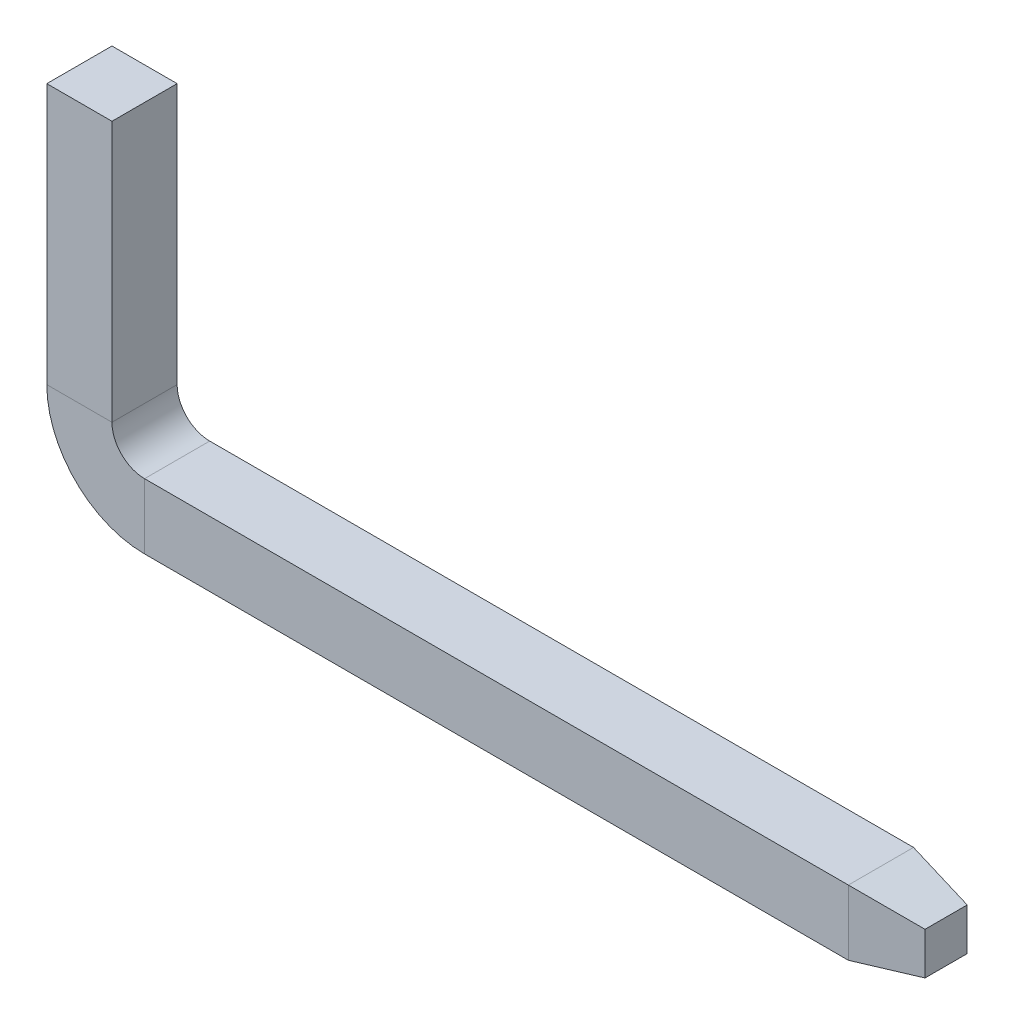
ISO-10303-21;
HEADER;
FILE_DESCRIPTION(('STEP AP214'),'2;1');
FILE_NAME('part.step','',(''),(''),'','','');
FILE_SCHEMA(('AUTOMOTIVE_DESIGN { 1 0 10303 214 1 1 1 1 }'));
ENDSEC;
DATA;
#1=APPLICATION_CONTEXT('core data for automotive mechanical design processes');
#2=APPLICATION_PROTOCOL_DEFINITION('international standard','automotive_design',2000,#1);
#3=PRODUCT_CONTEXT('',#1,'mechanical');
#4=PRODUCT('Part','Part','',(#3));
#5=PRODUCT_RELATED_PRODUCT_CATEGORY('part','',(#4));
#6=PRODUCT_DEFINITION_FORMATION('','',#4);
#7=PRODUCT_DEFINITION_CONTEXT('part definition',#1,'design');
#8=PRODUCT_DEFINITION('design','',#6,#7);
#9=PRODUCT_DEFINITION_SHAPE('','',#8);
#10=(LENGTH_UNIT() NAMED_UNIT(*) SI_UNIT(.MILLI.,.METRE.));
#11=(NAMED_UNIT(*) PLANE_ANGLE_UNIT() SI_UNIT($,.RADIAN.));
#12=(NAMED_UNIT(*) SI_UNIT($,.STERADIAN.) SOLID_ANGLE_UNIT());
#13=UNCERTAINTY_MEASURE_WITH_UNIT(LENGTH_MEASURE(1.E-05),#10,'distance_accuracy_value','');
#14=(GEOMETRIC_REPRESENTATION_CONTEXT(3) GLOBAL_UNCERTAINTY_ASSIGNED_CONTEXT((#13)) GLOBAL_UNIT_ASSIGNED_CONTEXT((#10,
#11,#12)) REPRESENTATION_CONTEXT('',''));
#15=CARTESIAN_POINT('',(0.,0.,0.));
#16=DIRECTION('',(0.,0.,1.));
#17=DIRECTION('',(1.,0.,0.));
#18=AXIS2_PLACEMENT_3D('',#15,#16,#17);
#19=CARTESIAN_POINT('',(0.,0.,0.));
#20=DIRECTION('',(0.,-1.,0.));
#21=DIRECTION('',(0.,0.,-1.));
#22=AXIS2_PLACEMENT_3D('',#19,#20,#21);
#23=PLANE('',#22);
#24=DIRECTION('',(0.,0.,-1.));
#25=VECTOR('',#24,1.);
#26=CARTESIAN_POINT('',(0.25,0.,0.25));
#27=LINE('',#26,#25);
#28=CARTESIAN_POINT('',(0.25,0.,0.25));
#29=VERTEX_POINT('',#28);
#30=CARTESIAN_POINT('',(0.25,0.,-0.25));
#31=VERTEX_POINT('',#30);
#32=EDGE_CURVE('E123',#29,#31,#27,.T.);
#33=ORIENTED_EDGE('',*,*,#32,.T.);
#34=DIRECTION('',(-1.,0.,0.));
#35=VECTOR('',#34,1.);
#36=CARTESIAN_POINT('',(-0.25,0.,-0.25));
#37=LINE('',#36,#35);
#38=CARTESIAN_POINT('',(-0.25,0.,-0.25));
#39=VERTEX_POINT('',#38);
#40=EDGE_CURVE('E151',#31,#39,#37,.T.);
#41=ORIENTED_EDGE('',*,*,#40,.T.);
#42=DIRECTION('',(0.,0.,1.));
#43=VECTOR('',#42,1.);
#44=CARTESIAN_POINT('',(-0.25,0.,0.25));
#45=LINE('',#44,#43);
#46=CARTESIAN_POINT('',(-0.25,0.,0.25));
#47=VERTEX_POINT('',#46);
#48=EDGE_CURVE('E154',#39,#47,#45,.T.);
#49=ORIENTED_EDGE('',*,*,#48,.T.);
#50=DIRECTION('',(1.,0.,0.));
#51=VECTOR('',#50,1.);
#52=CARTESIAN_POINT('',(-0.25,0.,0.25));
#53=LINE('',#52,#51);
#54=EDGE_CURVE('E171',#47,#29,#53,.T.);
#55=ORIENTED_EDGE('',*,*,#54,.T.);
#56=EDGE_LOOP('',(#33,#41,#49,#55));
#57=FACE_BOUND('',#56,.T.);
#58=ADVANCED_FACE('F32',(#57),#23,.F.);
#59=CARTESIAN_POINT('',(0.25,0.,0.25));
#60=DIRECTION('',(-1.,0.,0.));
#61=DIRECTION('',(0.,0.,1.));
#62=AXIS2_PLACEMENT_3D('',#59,#60,#61);
#63=PLANE('',#62);
#64=DIRECTION('',(0.,-1.,0.));
#65=VECTOR('',#64,1.);
#66=CARTESIAN_POINT('',(0.25,0.,-0.25));
#67=LINE('',#66,#65);
#68=CARTESIAN_POINT('',(0.25,-2.,-0.25));
#69=VERTEX_POINT('',#68);
#70=EDGE_CURVE('E159',#31,#69,#67,.T.);
#71=ORIENTED_EDGE('',*,*,#70,.F.);
#72=ORIENTED_EDGE('',*,*,#32,.F.);
#73=DIRECTION('',(0.,-1.,0.));
#74=VECTOR('',#73,1.);
#75=CARTESIAN_POINT('',(0.25,0.,0.25));
#76=LINE('',#75,#74);
#77=CARTESIAN_POINT('',(0.25,-2.,0.25));
#78=VERTEX_POINT('',#77);
#79=EDGE_CURVE('E186',#29,#78,#76,.T.);
#80=ORIENTED_EDGE('',*,*,#79,.T.);
#81=DIRECTION('',(0.,0.,-1.));
#82=VECTOR('',#81,1.);
#83=CARTESIAN_POINT('',(0.25,-2.,0.25));
#84=LINE('',#83,#82);
#85=EDGE_CURVE('E202',#78,#69,#84,.T.);
#86=ORIENTED_EDGE('',*,*,#85,.T.);
#87=EDGE_LOOP('',(#71,#72,#80,#86));
#88=FACE_BOUND('',#87,.T.);
#89=ADVANCED_FACE('F271',(#88),#63,.F.);
#90=CARTESIAN_POINT('',(-0.25,0.,-0.25));
#91=DIRECTION('',(0.,0.,1.));
#92=DIRECTION('',(1.,0.,0.));
#93=AXIS2_PLACEMENT_3D('',#90,#91,#92);
#94=PLANE('',#93);
#95=DIRECTION('',(0.,-1.,0.));
#96=VECTOR('',#95,1.);
#97=CARTESIAN_POINT('',(-0.25,0.,-0.25));
#98=LINE('',#97,#96);
#99=CARTESIAN_POINT('',(-0.25,-2.,-0.25));
#100=VERTEX_POINT('',#99);
#101=EDGE_CURVE('E158',#39,#100,#98,.T.);
#102=ORIENTED_EDGE('',*,*,#101,.F.);
#103=ORIENTED_EDGE('',*,*,#40,.F.);
#104=ORIENTED_EDGE('',*,*,#70,.T.);
#105=DIRECTION('',(-1.,0.,0.));
#106=VECTOR('',#105,1.);
#107=CARTESIAN_POINT('',(-0.25,-2.,-0.25));
#108=LINE('',#107,#106);
#109=EDGE_CURVE('E155',#69,#100,#108,.T.);
#110=ORIENTED_EDGE('',*,*,#109,.T.);
#111=EDGE_LOOP('',(#102,#103,#104,#110));
#112=FACE_BOUND('',#111,.T.);
#113=ADVANCED_FACE('F263',(#112),#94,.F.);
#114=CARTESIAN_POINT('',(-0.25,0.,0.25));
#115=DIRECTION('',(1.,0.,0.));
#116=DIRECTION('',(0.,0.,-1.));
#117=AXIS2_PLACEMENT_3D('',#114,#115,#116);
#118=PLANE('',#117);
#119=DIRECTION('',(0.,-1.,0.));
#120=VECTOR('',#119,1.);
#121=CARTESIAN_POINT('',(-0.25,0.,0.25));
#122=LINE('',#121,#120);
#123=CARTESIAN_POINT('',(-0.25,-2.,0.25));
#124=VERTEX_POINT('',#123);
#125=EDGE_CURVE('E174',#47,#124,#122,.T.);
#126=ORIENTED_EDGE('',*,*,#125,.F.);
#127=ORIENTED_EDGE('',*,*,#48,.F.);
#128=ORIENTED_EDGE('',*,*,#101,.T.);
#129=DIRECTION('',(0.,0.,1.));
#130=VECTOR('',#129,1.);
#131=CARTESIAN_POINT('',(-0.25,-2.,0.25));
#132=LINE('',#131,#130);
#133=EDGE_CURVE('E162',#100,#124,#132,.T.);
#134=ORIENTED_EDGE('',*,*,#133,.T.);
#135=EDGE_LOOP('',(#126,#127,#128,#134));
#136=FACE_BOUND('',#135,.T.);
#137=ADVANCED_FACE('F255',(#136),#118,.F.);
#138=CARTESIAN_POINT('',(-0.25,0.,0.25));
#139=DIRECTION('',(0.,0.,-1.));
#140=DIRECTION('',(-1.,0.,0.));
#141=AXIS2_PLACEMENT_3D('',#138,#139,#140);
#142=PLANE('',#141);
#143=DIRECTION('',(1.,0.,0.));
#144=VECTOR('',#143,1.);
#145=CARTESIAN_POINT('',(-0.25,-2.,0.25));
#146=LINE('',#145,#144);
#147=EDGE_CURVE('E177',#124,#78,#146,.T.);
#148=ORIENTED_EDGE('',*,*,#147,.T.);
#149=ORIENTED_EDGE('',*,*,#79,.F.);
#150=ORIENTED_EDGE('',*,*,#54,.F.);
#151=ORIENTED_EDGE('',*,*,#125,.T.);
#152=EDGE_LOOP('',(#148,#149,#150,#151));
#153=FACE_BOUND('',#152,.T.);
#154=ADVANCED_FACE('F253',(#153),#142,.F.);
#155=CARTESIAN_POINT('',(0.5,-2.,0.));
#156=DIRECTION('',(0.,0.,1.));
#157=DIRECTION('',(1.,0.,0.));
#158=AXIS2_PLACEMENT_3D('',#155,#156,#157);
#159=CYLINDRICAL_SURFACE('',#158,0.25);
#160=CARTESIAN_POINT('',(0.5,-2.,-0.25));
#161=DIRECTION('',(0.,0.,1.));
#162=DIRECTION('',(-1.,0.,0.));
#163=AXIS2_PLACEMENT_3D('',#160,#161,#162);
#164=CIRCLE('',#163,0.25);
#165=CARTESIAN_POINT('',(0.500000000000002,-2.25,-0.25));
#166=VERTEX_POINT('',#165);
#167=EDGE_CURVE('E164',#69,#166,#164,.T.);
#168=ORIENTED_EDGE('',*,*,#167,.F.);
#169=ORIENTED_EDGE('',*,*,#85,.F.);
#170=CARTESIAN_POINT('',(0.5,-2.,0.25));
#171=DIRECTION('',(0.,0.,1.));
#172=DIRECTION('',(-1.,0.,0.));
#173=AXIS2_PLACEMENT_3D('',#170,#171,#172);
#174=CIRCLE('',#173,0.25);
#175=CARTESIAN_POINT('',(0.500000000000002,-2.25,0.25));
#176=VERTEX_POINT('',#175);
#177=EDGE_CURVE('E188',#78,#176,#174,.T.);
#178=ORIENTED_EDGE('',*,*,#177,.T.);
#179=DIRECTION('',(0.,0.,-1.));
#180=VECTOR('',#179,1.);
#181=CARTESIAN_POINT('',(0.500000000000002,-2.25,0.25));
#182=LINE('',#181,#180);
#183=EDGE_CURVE('E196',#176,#166,#182,.T.);
#184=ORIENTED_EDGE('',*,*,#183,.T.);
#185=EDGE_LOOP('',(#168,#169,#178,#184));
#186=FACE_BOUND('',#185,.T.);
#187=ADVANCED_FACE('F200',(#186),#159,.F.);
#188=CARTESIAN_POINT('',(-0.25,-2.,-0.25));
#189=DIRECTION('',(0.,0.,1.));
#190=DIRECTION('',(1.,0.,0.));
#191=AXIS2_PLACEMENT_3D('',#188,#189,#190);
#192=PLANE('',#191);
#193=CARTESIAN_POINT('',(0.5,-2.,-0.25));
#194=DIRECTION('',(0.,0.,1.));
#195=DIRECTION('',(-1.,0.,0.));
#196=AXIS2_PLACEMENT_3D('',#193,#194,#195);
#197=CIRCLE('',#196,0.75);
#198=CARTESIAN_POINT('',(0.500000000000005,-2.75,-0.25));
#199=VERTEX_POINT('',#198);
#200=EDGE_CURVE('E77',#100,#199,#197,.T.);
#201=ORIENTED_EDGE('',*,*,#200,.F.);
#202=ORIENTED_EDGE('',*,*,#109,.F.);
#203=ORIENTED_EDGE('',*,*,#167,.T.);
#204=DIRECTION('',(0.,-1.,0.));
#205=VECTOR('',#204,1.);
#206=CARTESIAN_POINT('',(0.500000000000005,-2.75,-0.25));
#207=LINE('',#206,#205);
#208=EDGE_CURVE('E144',#166,#199,#207,.T.);
#209=ORIENTED_EDGE('',*,*,#208,.T.);
#210=EDGE_LOOP('',(#201,#202,#203,#209));
#211=FACE_BOUND('',#210,.T.);
#212=ADVANCED_FACE('F260',(#211),#192,.F.);
#213=CARTESIAN_POINT('',(0.5,-2.,0.));
#214=DIRECTION('',(0.,0.,1.));
#215=DIRECTION('',(1.,0.,0.));
#216=AXIS2_PLACEMENT_3D('',#213,#214,#215);
#217=CYLINDRICAL_SURFACE('',#216,0.75);
#218=CARTESIAN_POINT('',(0.5,-2.,0.25));
#219=DIRECTION('',(0.,0.,1.));
#220=DIRECTION('',(-1.,0.,0.));
#221=AXIS2_PLACEMENT_3D('',#218,#219,#220);
#222=CIRCLE('',#221,0.75);
#223=CARTESIAN_POINT('',(0.500000000000005,-2.75,0.25));
#224=VERTEX_POINT('',#223);
#225=EDGE_CURVE('E66',#124,#224,#222,.T.);
#226=ORIENTED_EDGE('',*,*,#225,.F.);
#227=ORIENTED_EDGE('',*,*,#133,.F.);
#228=ORIENTED_EDGE('',*,*,#200,.T.);
#229=DIRECTION('',(0.,0.,1.));
#230=VECTOR('',#229,1.);
#231=CARTESIAN_POINT('',(0.500000000000005,-2.75,0.25));
#232=LINE('',#231,#230);
#233=EDGE_CURVE('E165',#199,#224,#232,.T.);
#234=ORIENTED_EDGE('',*,*,#233,.T.);
#235=EDGE_LOOP('',(#226,#227,#228,#234));
#236=FACE_BOUND('',#235,.T.);
#237=ADVANCED_FACE('F252',(#236),#217,.T.);
#238=CARTESIAN_POINT('',(-0.25,-2.,0.25));
#239=DIRECTION('',(0.,0.,-1.));
#240=DIRECTION('',(-1.,0.,0.));
#241=AXIS2_PLACEMENT_3D('',#238,#239,#240);
#242=PLANE('',#241);
#243=DIRECTION('',(0.,1.,0.));
#244=VECTOR('',#243,1.);
#245=CARTESIAN_POINT('',(0.500000000000005,-2.75,0.25));
#246=LINE('',#245,#244);
#247=EDGE_CURVE('E150',#224,#176,#246,.T.);
#248=ORIENTED_EDGE('',*,*,#247,.T.);
#249=ORIENTED_EDGE('',*,*,#177,.F.);
#250=ORIENTED_EDGE('',*,*,#147,.F.);
#251=ORIENTED_EDGE('',*,*,#225,.T.);
#252=EDGE_LOOP('',(#248,#249,#250,#251));
#253=FACE_BOUND('',#252,.T.);
#254=ADVANCED_FACE('F192',(#253),#242,.F.);
#255=CARTESIAN_POINT('',(0.500000000000003,-2.25,0.25));
#256=DIRECTION('',(0.,-1.,0.));
#257=DIRECTION('',(0.,0.,-1.));
#258=AXIS2_PLACEMENT_3D('',#255,#256,#257);
#259=PLANE('',#258);
#260=DIRECTION('',(1.,0.,0.));
#261=VECTOR('',#260,1.);
#262=CARTESIAN_POINT('',(0.500000000000003,-2.25,-0.25));
#263=LINE('',#262,#261);
#264=CARTESIAN_POINT('',(5.9,-2.25,-0.25));
#265=VERTEX_POINT('',#264);
#266=EDGE_CURVE('E134',#166,#265,#263,.T.);
#267=ORIENTED_EDGE('',*,*,#266,.F.);
#268=ORIENTED_EDGE('',*,*,#183,.F.);
#269=DIRECTION('',(1.,0.,0.));
#270=VECTOR('',#269,1.);
#271=CARTESIAN_POINT('',(0.500000000000003,-2.25,0.25));
#272=LINE('',#271,#270);
#273=CARTESIAN_POINT('',(5.9,-2.25,0.25));
#274=VERTEX_POINT('',#273);
#275=EDGE_CURVE('E141',#176,#274,#272,.T.);
#276=ORIENTED_EDGE('',*,*,#275,.T.);
#277=DIRECTION('',(0.,0.,-1.));
#278=VECTOR('',#277,1.);
#279=CARTESIAN_POINT('',(5.9,-2.25,0.25));
#280=LINE('',#279,#278);
#281=EDGE_CURVE('E119',#274,#265,#280,.T.);
#282=ORIENTED_EDGE('',*,*,#281,.T.);
#283=EDGE_LOOP('',(#267,#268,#276,#282));
#284=FACE_BOUND('',#283,.T.);
#285=ADVANCED_FACE('F138',(#284),#259,.F.);
#286=CARTESIAN_POINT('',(0.500000000000003,-2.75,-0.25));
#287=DIRECTION('',(0.,0.,1.));
#288=DIRECTION('',(1.,0.,0.));
#289=AXIS2_PLACEMENT_3D('',#286,#287,#288);
#290=PLANE('',#289);
#291=DIRECTION('',(1.,0.,0.));
#292=VECTOR('',#291,1.);
#293=CARTESIAN_POINT('',(0.500000000000003,-2.75,-0.25));
#294=LINE('',#293,#292);
#295=CARTESIAN_POINT('',(5.9,-2.75,-0.25));
#296=VERTEX_POINT('',#295);
#297=EDGE_CURVE('E133',#199,#296,#294,.T.);
#298=ORIENTED_EDGE('',*,*,#297,.F.);
#299=ORIENTED_EDGE('',*,*,#208,.F.);
#300=ORIENTED_EDGE('',*,*,#266,.T.);
#301=DIRECTION('',(0.,-1.,0.));
#302=VECTOR('',#301,1.);
#303=CARTESIAN_POINT('',(5.9,-2.75,-0.25));
#304=LINE('',#303,#302);
#305=EDGE_CURVE('E127',#265,#296,#304,.T.);
#306=ORIENTED_EDGE('',*,*,#305,.T.);
#307=EDGE_LOOP('',(#298,#299,#300,#306));
#308=FACE_BOUND('',#307,.T.);
#309=ADVANCED_FACE('F143',(#308),#290,.F.);
#310=CARTESIAN_POINT('',(0.500000000000003,-2.75,0.25));
#311=DIRECTION('',(0.,1.,0.));
#312=DIRECTION('',(0.,0.,1.));
#313=AXIS2_PLACEMENT_3D('',#310,#311,#312);
#314=PLANE('',#313);
#315=DIRECTION('',(1.,0.,0.));
#316=VECTOR('',#315,1.);
#317=CARTESIAN_POINT('',(0.500000000000003,-2.75,0.25));
#318=LINE('',#317,#316);
#319=CARTESIAN_POINT('',(5.9,-2.75,0.25));
#320=VERTEX_POINT('',#319);
#321=EDGE_CURVE('E40',#224,#320,#318,.T.);
#322=ORIENTED_EDGE('',*,*,#321,.F.);
#323=ORIENTED_EDGE('',*,*,#233,.F.);
#324=ORIENTED_EDGE('',*,*,#297,.T.);
#325=DIRECTION('',(0.,0.,1.));
#326=VECTOR('',#325,1.);
#327=CARTESIAN_POINT('',(5.9,-2.75,0.25));
#328=LINE('',#327,#326);
#329=EDGE_CURVE('E168',#296,#320,#328,.T.);
#330=ORIENTED_EDGE('',*,*,#329,.T.);
#331=EDGE_LOOP('',(#322,#323,#324,#330));
#332=FACE_BOUND('',#331,.T.);
#333=ADVANCED_FACE('F230',(#332),#314,.F.);
#334=CARTESIAN_POINT('',(0.500000000000003,-2.75,0.25));
#335=DIRECTION('',(0.,0.,-1.));
#336=DIRECTION('',(-1.,0.,0.));
#337=AXIS2_PLACEMENT_3D('',#334,#335,#336);
#338=PLANE('',#337);
#339=DIRECTION('',(0.,1.,0.));
#340=VECTOR('',#339,1.);
#341=CARTESIAN_POINT('',(5.9,-2.75,0.25));
#342=LINE('',#341,#340);
#343=EDGE_CURVE('E11',#320,#274,#342,.T.);
#344=ORIENTED_EDGE('',*,*,#343,.T.);
#345=ORIENTED_EDGE('',*,*,#275,.F.);
#346=ORIENTED_EDGE('',*,*,#247,.F.);
#347=ORIENTED_EDGE('',*,*,#321,.T.);
#348=EDGE_LOOP('',(#344,#345,#346,#347));
#349=FACE_BOUND('',#348,.T.);
#350=ADVANCED_FACE('F232',(#349),#338,.F.);
#351=CARTESIAN_POINT('',(5.9,-2.75,-0.25));
#352=DIRECTION('',(0.173648177666931,0.,-0.984807753012208));
#353=DIRECTION('',(-0.984807753012208,0.,-0.173648177666931));
#354=AXIS2_PLACEMENT_3D('',#351,#352,#353);
#355=PLANE('',#354);
#356=ORIENTED_EDGE('',*,*,#305,.F.);
#357=DIRECTION('',(-0.970287525247814,0.171087869746036,-0.171087869746036));
#358=VECTOR('',#357,1.);
#359=CARTESIAN_POINT('',(5.9,-2.25,-0.25));
#360=LINE('',#359,#358);
#361=CARTESIAN_POINT('',(6.4,-2.33816349035423,-0.161836509645767));
#362=VERTEX_POINT('',#361);
#363=EDGE_CURVE('E115',#362,#265,#360,.T.);
#364=ORIENTED_EDGE('',*,*,#363,.F.);
#365=DIRECTION('',(0.,-1.,0.));
#366=VECTOR('',#365,1.);
#367=CARTESIAN_POINT('',(6.4,-2.75,-0.161836509645767));
#368=LINE('',#367,#366);
#369=CARTESIAN_POINT('',(6.4,-2.66183650964577,-0.161836509645767));
#370=VERTEX_POINT('',#369);
#371=EDGE_CURVE('E217',#370,#362,#368,.F.);
#372=ORIENTED_EDGE('',*,*,#371,.F.);
#373=DIRECTION('',(-0.970287525247814,-0.171087869746036,-0.171087869746036));
#374=VECTOR('',#373,1.);
#375=CARTESIAN_POINT('',(5.9,-2.75,-0.25));
#376=LINE('',#375,#374);
#377=EDGE_CURVE('E47',#370,#296,#376,.T.);
#378=ORIENTED_EDGE('',*,*,#377,.T.);
#379=EDGE_LOOP('',(#356,#364,#372,#378));
#380=FACE_BOUND('',#379,.T.);
#381=ADVANCED_FACE('F128',(#380),#355,.T.);
#382=CARTESIAN_POINT('',(5.9,-2.25,-0.25));
#383=DIRECTION('',(0.173648177666931,0.984807753012208,0.));
#384=DIRECTION('',(-0.984807753012208,0.173648177666931,0.));
#385=AXIS2_PLACEMENT_3D('',#382,#383,#384);
#386=PLANE('',#385);
#387=ORIENTED_EDGE('',*,*,#281,.F.);
#388=DIRECTION('',(-0.970287525247814,0.171087869746036,0.171087869746036));
#389=VECTOR('',#388,1.);
#390=CARTESIAN_POINT('',(5.9,-2.25,0.25));
#391=LINE('',#390,#389);
#392=CARTESIAN_POINT('',(6.4,-2.33816349035423,0.161836509645767));
#393=VERTEX_POINT('',#392);
#394=EDGE_CURVE('E124',#393,#274,#391,.T.);
#395=ORIENTED_EDGE('',*,*,#394,.F.);
#396=DIRECTION('',(0.,0.,-1.));
#397=VECTOR('',#396,1.);
#398=CARTESIAN_POINT('',(6.4,-2.33816349035423,-0.25));
#399=LINE('',#398,#397);
#400=EDGE_CURVE('E121',#362,#393,#399,.F.);
#401=ORIENTED_EDGE('',*,*,#400,.F.);
#402=ORIENTED_EDGE('',*,*,#363,.T.);
#403=EDGE_LOOP('',(#387,#395,#401,#402));
#404=FACE_BOUND('',#403,.T.);
#405=ADVANCED_FACE('F116',(#404),#386,.T.);
#406=CARTESIAN_POINT('',(5.9,-2.25,0.25));
#407=DIRECTION('',(0.173648177666931,0.,0.984807753012208));
#408=DIRECTION('',(0.984807753012208,0.,-0.173648177666931));
#409=AXIS2_PLACEMENT_3D('',#406,#407,#408);
#410=PLANE('',#409);
#411=ORIENTED_EDGE('',*,*,#343,.F.);
#412=DIRECTION('',(-0.970287525247814,-0.171087869746036,0.171087869746036));
#413=VECTOR('',#412,1.);
#414=CARTESIAN_POINT('',(5.9,-2.75,0.25));
#415=LINE('',#414,#413);
#416=CARTESIAN_POINT('',(6.4,-2.66183650964577,0.161836509645767));
#417=VERTEX_POINT('',#416);
#418=EDGE_CURVE('E220',#417,#320,#415,.T.);
#419=ORIENTED_EDGE('',*,*,#418,.F.);
#420=DIRECTION('',(0.,1.,0.));
#421=VECTOR('',#420,1.);
#422=CARTESIAN_POINT('',(6.4,-2.25,0.161836509645767));
#423=LINE('',#422,#421);
#424=EDGE_CURVE('E214',#393,#417,#423,.F.);
#425=ORIENTED_EDGE('',*,*,#424,.F.);
#426=ORIENTED_EDGE('',*,*,#394,.T.);
#427=EDGE_LOOP('',(#411,#419,#425,#426));
#428=FACE_BOUND('',#427,.T.);
#429=ADVANCED_FACE('F233',(#428),#410,.T.);
#430=CARTESIAN_POINT('',(5.9,-2.75,0.25));
#431=DIRECTION('',(0.173648177666931,-0.984807753012208,0.));
#432=DIRECTION('',(0.984807753012208,0.173648177666931,0.));
#433=AXIS2_PLACEMENT_3D('',#430,#431,#432);
#434=PLANE('',#433);
#435=ORIENTED_EDGE('',*,*,#329,.F.);
#436=ORIENTED_EDGE('',*,*,#377,.F.);
#437=DIRECTION('',(0.,0.,1.));
#438=VECTOR('',#437,1.);
#439=CARTESIAN_POINT('',(6.4,-2.66183650964577,0.25));
#440=LINE('',#439,#438);
#441=EDGE_CURVE('E212',#417,#370,#440,.F.);
#442=ORIENTED_EDGE('',*,*,#441,.F.);
#443=ORIENTED_EDGE('',*,*,#418,.T.);
#444=EDGE_LOOP('',(#435,#436,#442,#443));
#445=FACE_BOUND('',#444,.T.);
#446=ADVANCED_FACE('F226',(#445),#434,.T.);
#447=CARTESIAN_POINT('',(6.4,0.,0.));
#448=DIRECTION('',(1.,0.,0.));
#449=DIRECTION('',(0.,0.,-1.));
#450=AXIS2_PLACEMENT_3D('',#447,#448,#449);
#451=PLANE('',#450);
#452=ORIENTED_EDGE('',*,*,#371,.T.);
#453=ORIENTED_EDGE('',*,*,#400,.T.);
#454=ORIENTED_EDGE('',*,*,#424,.T.);
#455=ORIENTED_EDGE('',*,*,#441,.T.);
#456=EDGE_LOOP('',(#452,#453,#454,#455));
#457=FACE_BOUND('',#456,.T.);
#458=ADVANCED_FACE('F235',(#457),#451,.T.);
#459=CLOSED_SHELL('',(#58,#89,#113,#137,#154,#187,#212,#237,#254,#285,#309,#333,#350,#381,#405,
#429,#446,#458));
#460=MANIFOLD_SOLID_BREP('B2',#459);
#461=ADVANCED_BREP_SHAPE_REPRESENTATION('',(#18,#460),#14);
#462=SHAPE_DEFINITION_REPRESENTATION(#9,#461);
ENDSEC;
END-ISO-10303-21;
